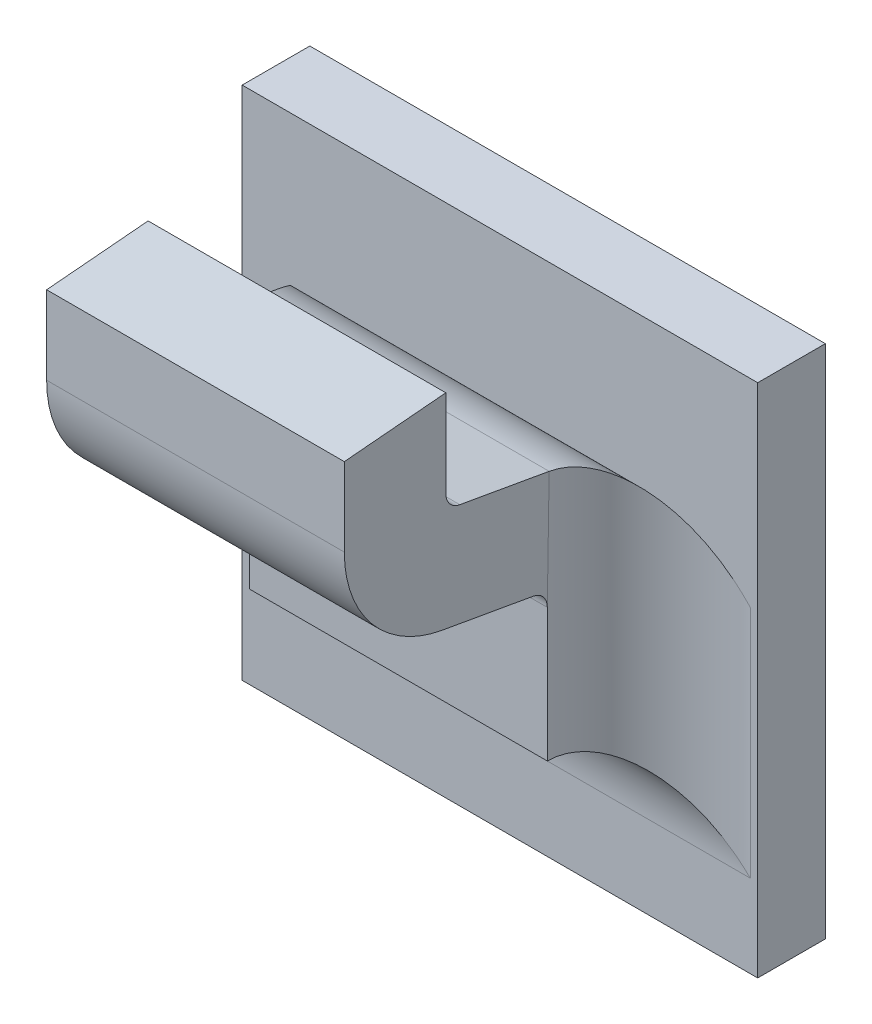
ISO-10303-21;
HEADER;
FILE_DESCRIPTION(('STEP AP214'),'2;1');
FILE_NAME('part.step','',(''),(''),'','','');
FILE_SCHEMA(('AUTOMOTIVE_DESIGN { 1 0 10303 214 1 1 1 1 }'));
ENDSEC;
DATA;
#1=APPLICATION_CONTEXT('core data for automotive mechanical design processes');
#2=APPLICATION_PROTOCOL_DEFINITION('international standard','automotive_design',2000,#1);
#3=PRODUCT_CONTEXT('',#1,'mechanical');
#4=PRODUCT('Part','Part','',(#3));
#5=PRODUCT_RELATED_PRODUCT_CATEGORY('part','',(#4));
#6=PRODUCT_DEFINITION_FORMATION('','',#4);
#7=PRODUCT_DEFINITION_CONTEXT('part definition',#1,'design');
#8=PRODUCT_DEFINITION('design','',#6,#7);
#9=PRODUCT_DEFINITION_SHAPE('','',#8);
#10=(LENGTH_UNIT() NAMED_UNIT(*) SI_UNIT(.MILLI.,.METRE.));
#11=(NAMED_UNIT(*) PLANE_ANGLE_UNIT() SI_UNIT($,.RADIAN.));
#12=(NAMED_UNIT(*) SI_UNIT($,.STERADIAN.) SOLID_ANGLE_UNIT());
#13=UNCERTAINTY_MEASURE_WITH_UNIT(LENGTH_MEASURE(1.E-05),#10,'distance_accuracy_value','');
#14=(GEOMETRIC_REPRESENTATION_CONTEXT(3) GLOBAL_UNCERTAINTY_ASSIGNED_CONTEXT((#13)) GLOBAL_UNIT_ASSIGNED_CONTEXT((#10,
#11,#12)) REPRESENTATION_CONTEXT('',''));
#15=CARTESIAN_POINT('',(0.,0.,0.));
#16=DIRECTION('',(0.,0.,1.));
#17=DIRECTION('',(1.,0.,0.));
#18=AXIS2_PLACEMENT_3D('',#15,#16,#17);
#19=CARTESIAN_POINT('',(0.184690982808015,-0.482280853090536,0.0797273267071123));
#20=DIRECTION('',(1.,0.,0.));
#21=DIRECTION('',(0.,1.,0.));
#22=AXIS2_PLACEMENT_3D('',#19,#20,#21);
#23=CYLINDRICAL_SURFACE('',#22,0.00098425196850394);
#24=DIRECTION('',(1.,0.,0.));
#25=VECTOR('',#24,1.);
#26=CARTESIAN_POINT('',(0.165635864697779,-0.482280853090536,0.0807115786756163));
#27=LINE('',#26,#25);
#28=CARTESIAN_POINT('',(0.183824841075731,-0.482280853090536,0.0807115786756163));
#29=VERTEX_POINT('',#28);
#30=CARTESIAN_POINT('',(0.166502006430062,-0.482280853090536,0.0807115786756163));
#31=VERTEX_POINT('',#30);
#32=EDGE_CURVE('E182',#29,#31,#27,.F.);
#33=ORIENTED_EDGE('',*,*,#32,.F.);
#34=CARTESIAN_POINT('',(0.183824841075731,-0.482280853090536,0.0797273267071123));
#35=DIRECTION('',(1.,0.,0.));
#36=DIRECTION('',(0.,1.,0.));
#37=AXIS2_PLACEMENT_3D('',#34,#35,#36);
#38=CIRCLE('',#37,0.00098425196850394);
#39=CARTESIAN_POINT('',(0.183824841075731,-0.483250152060037,0.0798982402678082));
#40=VERTEX_POINT('',#39);
#41=EDGE_CURVE('E155',#40,#29,#38,.F.);
#42=ORIENTED_EDGE('',*,*,#41,.F.);
#43=DIRECTION('',(1.,0.,0.));
#44=VECTOR('',#43,1.);
#45=CARTESIAN_POINT('',(0.165631671913121,-0.483250152060037,0.0798982402678081));
#46=LINE('',#45,#44);
#47=CARTESIAN_POINT('',(0.166502006430062,-0.483250152060037,0.0798982402678082));
#48=VERTEX_POINT('',#47);
#49=EDGE_CURVE('E137',#48,#40,#46,.T.);
#50=ORIENTED_EDGE('',*,*,#49,.F.);
#51=CARTESIAN_POINT('',(0.166502006430062,-0.482280853090536,0.0797273267071123));
#52=DIRECTION('',(1.,0.,0.));
#53=DIRECTION('',(0.,1.,0.));
#54=AXIS2_PLACEMENT_3D('',#51,#52,#53);
#55=CIRCLE('',#54,0.00098425196850394);
#56=EDGE_CURVE('E148',#48,#31,#55,.F.);
#57=ORIENTED_EDGE('',*,*,#56,.T.);
#58=EDGE_LOOP('',(#33,#42,#50,#57));
#59=FACE_BOUND('',#58,.T.);
#60=ADVANCED_FACE('F17',(#59),#23,.F.);
#61=CARTESIAN_POINT('',(0.165635864697779,-0.482534695884412,0.0807115786756163));
#62=DIRECTION('',(0.,0.,-1.));
#63=DIRECTION('',(0.,1.,0.));
#64=AXIS2_PLACEMENT_3D('',#61,#62,#63);
#65=PLANE('',#64);
#66=ORIENTED_EDGE('',*,*,#32,.T.);
#67=DIRECTION('',(0.,1.,0.));
#68=VECTOR('',#67,1.);
#69=CARTESIAN_POINT('',(0.166502006430062,-0.491658866021042,0.0807115786756163));
#70=LINE('',#69,#68);
#71=CARTESIAN_POINT('',(0.166502006430062,-0.477203997213029,0.0807115786756163));
#72=VERTEX_POINT('',#71);
#73=EDGE_CURVE('E177',#31,#72,#70,.T.);
#74=ORIENTED_EDGE('',*,*,#73,.T.);
#75=DIRECTION('',(1.,0.,0.));
#76=VECTOR('',#75,1.);
#77=CARTESIAN_POINT('',(0.137663423752897,-0.477203997213029,0.0807115786756163));
#78=LINE('',#77,#76);
#79=CARTESIAN_POINT('',(0.183824841075731,-0.477203997213029,0.0807115786756163));
#80=VERTEX_POINT('',#79);
#81=EDGE_CURVE('E170',#72,#80,#78,.T.);
#82=ORIENTED_EDGE('',*,*,#81,.T.);
#83=DIRECTION('',(0.,1.,0.));
#84=VECTOR('',#83,1.);
#85=CARTESIAN_POINT('',(0.183824841075731,-0.491658866021042,0.0807115786756163));
#86=LINE('',#85,#84);
#87=EDGE_CURVE('E189',#29,#80,#86,.T.);
#88=ORIENTED_EDGE('',*,*,#87,.F.);
#89=EDGE_LOOP('',(#66,#74,#82,#88));
#90=FACE_BOUND('',#89,.T.);
#91=ADVANCED_FACE('F376',(#90),#65,.T.);
#92=CARTESIAN_POINT('',(0.137663423752897,-0.477562594630968,0.0848103659183002));
#93=DIRECTION('',(0.,-0.996194698091746,-0.0871557427476516));
#94=DIRECTION('',(0.,0.0871557427476516,-0.996194698091746));
#95=AXIS2_PLACEMENT_3D('',#92,#93,#94);
#96=PLANE('',#95);
#97=DIRECTION('',(0.,-0.0871557427476615,0.996194698091745));
#98=VECTOR('',#97,1.);
#99=CARTESIAN_POINT('',(0.183824841075731,-0.477203997213029,0.0807115786756163));
#100=LINE('',#99,#98);
#101=CARTESIAN_POINT('',(0.183824841075731,-0.477720662548812,0.0866170904866399));
#102=VERTEX_POINT('',#101);
#103=EDGE_CURVE('E186',#80,#102,#100,.T.);
#104=ORIENTED_EDGE('',*,*,#103,.F.);
#105=ORIENTED_EDGE('',*,*,#81,.F.);
#106=DIRECTION('',(0.,-0.0871557427476615,0.996194698091745));
#107=VECTOR('',#106,1.);
#108=CARTESIAN_POINT('',(0.166502006430062,-0.477203997213029,0.0807115786756163));
#109=LINE('',#108,#107);
#110=CARTESIAN_POINT('',(0.166502006430062,-0.477720662548812,0.08661709048664));
#111=VERTEX_POINT('',#110);
#112=EDGE_CURVE('E173',#72,#111,#109,.T.);
#113=ORIENTED_EDGE('',*,*,#112,.T.);
#114=DIRECTION('',(1.,0.,0.));
#115=VECTOR('',#114,1.);
#116=CARTESIAN_POINT('',(0.165635864697779,-0.477720662548812,0.0866170904866399));
#117=LINE('',#116,#115);
#118=EDGE_CURVE('E167',#111,#102,#117,.T.);
#119=ORIENTED_EDGE('',*,*,#118,.T.);
#120=EDGE_LOOP('',(#104,#105,#113,#119));
#121=FACE_BOUND('',#120,.T.);
#122=ADVANCED_FACE('F380',(#121),#96,.F.);
#123=CARTESIAN_POINT('',(0.165635864697779,-0.482508862617623,0.0866170904866399));
#124=DIRECTION('',(0.,0.,-1.));
#125=DIRECTION('',(0.,1.,0.));
#126=AXIS2_PLACEMENT_3D('',#123,#124,#125);
#127=PLANE('',#126);
#128=ORIENTED_EDGE('',*,*,#118,.F.);
#129=DIRECTION('',(0.,1.,0.));
#130=VECTOR('',#129,1.);
#131=CARTESIAN_POINT('',(0.166502006430062,-0.491658866021042,0.08661709048664));
#132=LINE('',#131,#130);
#133=CARTESIAN_POINT('',(0.166502006430062,-0.482280853090536,0.0866170904866399));
#134=VERTEX_POINT('',#133);
#135=EDGE_CURVE('E176',#111,#134,#132,.F.);
#136=ORIENTED_EDGE('',*,*,#135,.T.);
#137=DIRECTION('',(1.,0.,0.));
#138=VECTOR('',#137,1.);
#139=CARTESIAN_POINT('',(0.184690982808015,-0.482280853090536,0.0866170904866399));
#140=LINE('',#139,#138);
#141=CARTESIAN_POINT('',(0.183824841075731,-0.482280853090536,0.0866170904866399));
#142=VERTEX_POINT('',#141);
#143=EDGE_CURVE('E165',#142,#134,#140,.F.);
#144=ORIENTED_EDGE('',*,*,#143,.F.);
#145=DIRECTION('',(0.,1.,0.));
#146=VECTOR('',#145,1.);
#147=CARTESIAN_POINT('',(0.183824841075731,-0.491658866021042,0.08661709048664));
#148=LINE('',#147,#146);
#149=EDGE_CURVE('E188',#102,#142,#148,.F.);
#150=ORIENTED_EDGE('',*,*,#149,.F.);
#151=EDGE_LOOP('',(#128,#136,#144,#150));
#152=FACE_BOUND('',#151,.T.);
#153=ADVANCED_FACE('F384',(#152),#127,.F.);
#154=CARTESIAN_POINT('',(0.184690982808015,-0.482280853090536,0.0797273267071123));
#155=DIRECTION('',(1.,0.,0.));
#156=DIRECTION('',(0.,1.,0.));
#157=AXIS2_PLACEMENT_3D('',#154,#155,#156);
#158=CYLINDRICAL_SURFACE('',#157,0.00688976377952756);
#159=CARTESIAN_POINT('',(0.183824841075731,-0.482280853090536,0.0797273267071123));
#160=DIRECTION('',(1.,0.,0.));
#161=DIRECTION('',(0.,1.,0.));
#162=AXIS2_PLACEMENT_3D('',#159,#160,#161);
#163=CIRCLE('',#162,0.00688976377952756);
#164=CARTESIAN_POINT('',(0.183824841075731,-0.489065945877038,0.0809237216319825));
#165=VERTEX_POINT('',#164);
#166=EDGE_CURVE('E146',#142,#165,#163,.T.);
#167=ORIENTED_EDGE('',*,*,#166,.F.);
#168=ORIENTED_EDGE('',*,*,#143,.T.);
#169=CARTESIAN_POINT('',(0.166502006430062,-0.482280853090536,0.0797273267071123));
#170=DIRECTION('',(1.,0.,0.));
#171=DIRECTION('',(0.,1.,0.));
#172=AXIS2_PLACEMENT_3D('',#169,#170,#171);
#173=CIRCLE('',#172,0.00688976377952756);
#174=CARTESIAN_POINT('',(0.166502006430062,-0.489065945877038,0.0809237216319825));
#175=VERTEX_POINT('',#174);
#176=EDGE_CURVE('E235',#134,#175,#173,.T.);
#177=ORIENTED_EDGE('',*,*,#176,.T.);
#178=DIRECTION('',(1.,0.,0.));
#179=VECTOR('',#178,1.);
#180=CARTESIAN_POINT('',(0.165635864697779,-0.489065945877038,0.0809237216319829));
#181=LINE('',#180,#179);
#182=EDGE_CURVE('E138',#175,#165,#181,.T.);
#183=ORIENTED_EDGE('',*,*,#182,.T.);
#184=EDGE_LOOP('',(#167,#168,#177,#183));
#185=FACE_BOUND('',#184,.T.);
#186=ADVANCED_FACE('F388',(#185),#158,.T.);
#187=CARTESIAN_POINT('',(0.165635864697779,-0.490048004669866,0.0753541894544217));
#188=DIRECTION('',(0.,0.984807753012208,-0.17364817766693));
#189=DIRECTION('',(0.,0.17364817766693,0.984807753012208));
#190=AXIS2_PLACEMENT_3D('',#187,#188,#189);
#191=PLANE('',#190);
#192=DIRECTION('',(1.,0.,0.));
#193=VECTOR('',#192,1.);
#194=CARTESIAN_POINT('',(0.184690982808015,-0.490001239965446,0.0756194052724009));
#195=LINE('',#194,#193);
#196=CARTESIAN_POINT('',(0.166502006430062,-0.490001239965445,0.0756194052724009));
#197=VERTEX_POINT('',#196);
#198=CARTESIAN_POINT('',(0.183824841075731,-0.490001239965445,0.0756194052724009));
#199=VERTEX_POINT('',#198);
#200=EDGE_CURVE('E127',#197,#199,#195,.T.);
#201=ORIENTED_EDGE('',*,*,#200,.T.);
#202=DIRECTION('',(0.,-0.173648177666803,-0.98480775301223));
#203=VECTOR('',#202,1.);
#204=CARTESIAN_POINT('',(0.183824841075731,-0.489065945877038,0.0809237216319829));
#205=LINE('',#204,#203);
#206=EDGE_CURVE('E130',#165,#199,#205,.T.);
#207=ORIENTED_EDGE('',*,*,#206,.F.);
#208=ORIENTED_EDGE('',*,*,#182,.F.);
#209=DIRECTION('',(0.,-0.173648177666803,-0.98480775301223));
#210=VECTOR('',#209,1.);
#211=CARTESIAN_POINT('',(0.166502006430062,-0.489065945877038,0.0809237216319829));
#212=LINE('',#211,#210);
#213=EDGE_CURVE('E132',#175,#197,#212,.T.);
#214=ORIENTED_EDGE('',*,*,#213,.T.);
#215=EDGE_LOOP('',(#201,#207,#208,#214));
#216=FACE_BOUND('',#215,.T.);
#217=ADVANCED_FACE('F129',(#216),#191,.F.);
#218=CARTESIAN_POINT('',(0.184690982808015,-0.490970538934946,0.0757903188330966));
#219=DIRECTION('',(1.,0.,0.));
#220=DIRECTION('',(0.,1.,0.));
#221=AXIS2_PLACEMENT_3D('',#218,#219,#220);
#222=CYLINDRICAL_SURFACE('',#221,0.00098425196850394);
#223=DIRECTION('',(1.,0.,0.));
#224=VECTOR('',#223,1.);
#225=CARTESIAN_POINT('',(0.165635864697779,-0.490970538934946,0.0748060668645926));
#226=LINE('',#225,#224);
#227=CARTESIAN_POINT('',(0.166502006430062,-0.490970538934946,0.0748060668645927));
#228=VERTEX_POINT('',#227);
#229=CARTESIAN_POINT('',(0.183824841075731,-0.490970538934946,0.0748060668645926));
#230=VERTEX_POINT('',#229);
#231=EDGE_CURVE('E151',#228,#230,#226,.T.);
#232=ORIENTED_EDGE('',*,*,#231,.T.);
#233=CARTESIAN_POINT('',(0.183824841075731,-0.490970538934946,0.0757903188330966));
#234=DIRECTION('',(1.,0.,0.));
#235=DIRECTION('',(0.,1.,0.));
#236=AXIS2_PLACEMENT_3D('',#233,#234,#235);
#237=CIRCLE('',#236,0.00098425196850394);
#238=EDGE_CURVE('E20',#199,#230,#237,.F.);
#239=ORIENTED_EDGE('',*,*,#238,.F.);
#240=ORIENTED_EDGE('',*,*,#200,.F.);
#241=CARTESIAN_POINT('',(0.166502006430062,-0.490970538934946,0.0757903188330966));
#242=DIRECTION('',(1.,0.,0.));
#243=DIRECTION('',(0.,1.,0.));
#244=AXIS2_PLACEMENT_3D('',#241,#242,#243);
#245=CIRCLE('',#244,0.00098425196850394);
#246=EDGE_CURVE('E232',#197,#228,#245,.F.);
#247=ORIENTED_EDGE('',*,*,#246,.T.);
#248=EDGE_LOOP('',(#232,#239,#240,#247));
#249=FACE_BOUND('',#248,.T.);
#250=ADVANCED_FACE('F150',(#249),#222,.F.);
#251=CARTESIAN_POINT('',(0.165631671913121,-0.484232210852865,0.0743287080902469));
#252=DIRECTION('',(0.,0.984807753012208,-0.17364817766693));
#253=DIRECTION('',(0.,0.17364817766693,0.984807753012208));
#254=AXIS2_PLACEMENT_3D('',#251,#252,#253);
#255=PLANE('',#254);
#256=DIRECTION('',(0.,0.173648177666938,0.984807753012207));
#257=VECTOR('',#256,1.);
#258=CARTESIAN_POINT('',(0.183824841075731,-0.48414803962147,0.0748060668645927));
#259=LINE('',#258,#257);
#260=CARTESIAN_POINT('',(0.18382674688694,-0.484166742884957,0.0746999953864094));
#261=VERTEX_POINT('',#260);
#262=EDGE_CURVE('E153',#261,#40,#259,.T.);
#263=ORIENTED_EDGE('',*,*,#262,.F.);
#264=DIRECTION('',(1.,0.,0.));
#265=VECTOR('',#264,1.);
#266=CARTESIAN_POINT('',(0.191187045800141,-0.484185446148445,0.0745939239082261));
#267=LINE('',#266,#265);
#268=CARTESIAN_POINT('',(0.166500100618853,-0.484166742884957,0.0746999953864094));
#269=VERTEX_POINT('',#268);
#270=EDGE_CURVE('E264',#269,#261,#267,.T.);
#271=ORIENTED_EDGE('',*,*,#270,.F.);
#272=DIRECTION('',(0.,0.173648177666938,0.984807753012207));
#273=VECTOR('',#272,1.);
#274=CARTESIAN_POINT('',(0.166502006430062,-0.48414803962147,0.0748060668645927));
#275=LINE('',#274,#273);
#276=EDGE_CURVE('E234',#269,#48,#275,.T.);
#277=ORIENTED_EDGE('',*,*,#276,.T.);
#278=ORIENTED_EDGE('',*,*,#49,.T.);
#279=EDGE_LOOP('',(#263,#271,#277,#278));
#280=FACE_BOUND('',#279,.T.);
#281=ADVANCED_FACE('F373',(#280),#255,.T.);
#282=CARTESIAN_POINT('',(0.183824841075731,-0.491658866021042,0.0742155156834903));
#283=DIRECTION('',(1.,0.,0.));
#284=DIRECTION('',(0.,1.,0.));
#285=AXIS2_PLACEMENT_3D('',#282,#283,#284);
#286=PLANE('',#285);
#287=ORIENTED_EDGE('',*,*,#166,.T.);
#288=ORIENTED_EDGE('',*,*,#206,.T.);
#289=ORIENTED_EDGE('',*,*,#238,.T.);
#290=DIRECTION('',(0.,-1.,0.));
#291=VECTOR('',#290,1.);
#292=CARTESIAN_POINT('',(0.183824841075731,-0.505642557779639,0.0748060668645926));
#293=LINE('',#292,#291);
#294=EDGE_CURVE('E271',#230,#261,#293,.F.);
#295=ORIENTED_EDGE('',*,*,#294,.T.);
#296=ORIENTED_EDGE('',*,*,#262,.T.);
#297=ORIENTED_EDGE('',*,*,#41,.T.);
#298=ORIENTED_EDGE('',*,*,#87,.T.);
#299=ORIENTED_EDGE('',*,*,#103,.T.);
#300=ORIENTED_EDGE('',*,*,#149,.T.);
#301=EDGE_LOOP('',(#287,#288,#289,#295,#296,#297,#298,#299,#300));
#302=FACE_BOUND('',#301,.T.);
#303=ADVANCED_FACE('F142',(#302),#286,.T.);
#304=CARTESIAN_POINT('',(0.166502006430062,-0.491658866021042,0.0742155156834903));
#305=DIRECTION('',(1.,0.,0.));
#306=DIRECTION('',(0.,1.,0.));
#307=AXIS2_PLACEMENT_3D('',#304,#305,#306);
#308=PLANE('',#307);
#309=DIRECTION('',(0.,1.,0.));
#310=VECTOR('',#309,1.);
#311=CARTESIAN_POINT('',(0.166502006430062,-0.483124491137747,0.0748060668645927));
#312=LINE('',#311,#310);
#313=EDGE_CURVE('E290',#269,#228,#312,.F.);
#314=ORIENTED_EDGE('',*,*,#313,.T.);
#315=ORIENTED_EDGE('',*,*,#246,.F.);
#316=ORIENTED_EDGE('',*,*,#213,.F.);
#317=ORIENTED_EDGE('',*,*,#176,.F.);
#318=ORIENTED_EDGE('',*,*,#135,.F.);
#319=ORIENTED_EDGE('',*,*,#112,.F.);
#320=ORIENTED_EDGE('',*,*,#73,.F.);
#321=ORIENTED_EDGE('',*,*,#56,.F.);
#322=ORIENTED_EDGE('',*,*,#276,.F.);
#323=EDGE_LOOP('',(#314,#315,#316,#317,#318,#319,#320,#321,#322));
#324=FACE_BOUND('',#323,.T.);
#325=ADVANCED_FACE('F371',(#324),#308,.F.);
#326=CARTESIAN_POINT('',(0.165635864697779,-0.49910064541239,0.0748060668645926));
#327=DIRECTION('',(0.,0.,-1.));
#328=DIRECTION('',(0.,1.,0.));
#329=AXIS2_PLACEMENT_3D('',#326,#327,#328);
#330=PLANE('',#329);
#331=DIRECTION('',(-1.,0.,0.));
#332=VECTOR('',#331,1.);
#333=CARTESIAN_POINT('',(0.137663423752897,-0.498713497484892,0.0748060668645926));
#334=LINE('',#333,#332);
#335=CARTESIAN_POINT('',(0.166502006430062,-0.498713497484892,0.0748060668645926));
#336=VERTEX_POINT('',#335);
#337=CARTESIAN_POINT('',(0.183824841075731,-0.498713497484892,0.0748060668645926));
#338=VERTEX_POINT('',#337);
#339=EDGE_CURVE('E275',#336,#338,#334,.F.);
#340=ORIENTED_EDGE('',*,*,#339,.T.);
#341=DIRECTION('',(0.,-1.,0.));
#342=VECTOR('',#341,1.);
#343=CARTESIAN_POINT('',(0.183824841075731,-0.505642557779639,0.0748060668645926));
#344=LINE('',#343,#342);
#345=EDGE_CURVE('E268',#338,#230,#344,.F.);
#346=ORIENTED_EDGE('',*,*,#345,.T.);
#347=ORIENTED_EDGE('',*,*,#231,.F.);
#348=DIRECTION('',(0.,1.,0.));
#349=VECTOR('',#348,1.);
#350=CARTESIAN_POINT('',(0.166502006430062,-0.483124491137747,0.0748060668645926));
#351=LINE('',#350,#349);
#352=EDGE_CURVE('E293',#228,#336,#351,.F.);
#353=ORIENTED_EDGE('',*,*,#352,.T.);
#354=EDGE_LOOP('',(#340,#346,#347,#353));
#355=FACE_BOUND('',#354,.T.);
#356=ADVANCED_FACE('F369',(#355),#330,.F.);
#357=CARTESIAN_POINT('',(0.191187045800141,-0.490970538934946,0.0757903188330966));
#358=DIRECTION('',(1.,0.,0.));
#359=DIRECTION('',(0.,1.,0.));
#360=AXIS2_PLACEMENT_3D('',#357,#358,#359);
#361=CYLINDRICAL_SURFACE('',#360,0.00688976377952756);
#362=ORIENTED_EDGE('',*,*,#270,.T.);
#363=CARTESIAN_POINT('',(0.18382584705188,-0.484167631527071,0.0747001216257358));
#364=CARTESIAN_POINT('',(0.183830746400047,-0.484214408974995,0.0744052234333631));
#365=CARTESIAN_POINT('',(0.183858349030783,-0.484280966886792,0.074115034151789));
#366=CARTESIAN_POINT('',(0.183952289382906,-0.484447482121032,0.073553844729337));
#367=CARTESIAN_POINT('',(0.184018258902216,-0.484547118148503,0.0732826892737776));
#368=CARTESIAN_POINT('',(0.184182242620427,-0.484774233375055,0.0727646055784552));
#369=CARTESIAN_POINT('',(0.184280119745007,-0.484901592711233,0.0725175794773051));
#370=CARTESIAN_POINT('',(0.184501721201638,-0.485178958131144,0.0720485533086558));
#371=CARTESIAN_POINT('',(0.184625512286216,-0.485329022418919,0.0718266201983146));
#372=CARTESIAN_POINT('',(0.184961780246565,-0.485728040852456,0.0713022915327616));
#373=CARTESIAN_POINT('',(0.185187229821375,-0.485988312130857,0.0710168133445038));
#374=CARTESIAN_POINT('',(0.185669306450927,-0.486535947935682,0.070504056702723));
#375=CARTESIAN_POINT('',(0.185926004972526,-0.486823374216995,0.0702769154978246));
#376=CARTESIAN_POINT('',(0.186560055176599,-0.487527037812419,0.0698026326616958));
#377=CARTESIAN_POINT('',(0.186946643806099,-0.487951268913421,0.0695797433223629));
#378=CARTESIAN_POINT('',(0.187740499974624,-0.488817388979215,0.0692289934880923));
#379=CARTESIAN_POINT('',(0.188147751769603,-0.489259264447,0.0691010617693635));
#380=CARTESIAN_POINT('',(0.188829419657663,-0.489997147024509,0.0689631980798835));
#381=CARTESIAN_POINT('',(0.189101299537579,-0.490291001061431,0.0689278051732856));
#382=CARTESIAN_POINT('',(0.189492532956124,-0.490713663984163,0.0689041494171859));
#383=CARTESIAN_POINT('',(0.189611448383415,-0.490842107141949,0.068900564537093));
#384=CARTESIAN_POINT('',(0.189730352886755,-0.490970538934946,0.068900555053569));
#385=B_SPLINE_CURVE_WITH_KNOTS('',3,(#363,#364,#365,#366,#367,#368,#369,#370,#371,#372,#373,
#374,#375,#376,#377,#378,#379,#380,#381,#382,#383,#384),.UNSPECIFIED.,.F.,.F.,(4,2,2,2,2,2,2,2,
2,2,4),(0.,0.000892674275674727,0.00177691981761761,0.00265741564566999,0.00354020811045546,
0.00487460341316192,0.00621210995073975,0.00804949445936676,0.00988549942521251,0.011089431284,
0.0116145091100796),.UNSPECIFIED.);
#386=CARTESIAN_POINT('',(0.189730352886755,-0.490970538934946,0.068900555053569));
#387=VERTEX_POINT('',#386);
#388=EDGE_CURVE('E231',#261,#387,#385,.T.);
#389=ORIENTED_EDGE('',*,*,#388,.T.);
#390=DIRECTION('',(1.,0.,0.));
#391=VECTOR('',#390,1.);
#392=CARTESIAN_POINT('',(0.137663423752897,-0.490970538934946,0.068900555053569));
#393=LINE('',#392,#391);
#394=CARTESIAN_POINT('',(0.160596494619038,-0.490970538934946,0.068900555053569));
#395=VERTEX_POINT('',#394);
#396=EDGE_CURVE('E195',#395,#387,#393,.T.);
#397=ORIENTED_EDGE('',*,*,#396,.F.);
#398=CARTESIAN_POINT('',(0.166501000453913,-0.484167631527071,0.0747001216257358));
#399=CARTESIAN_POINT('',(0.166496101105746,-0.484214408974995,0.0744052234333631));
#400=CARTESIAN_POINT('',(0.16646849847501,-0.484280966886792,0.0741150341517891));
#401=CARTESIAN_POINT('',(0.166374558122887,-0.484447482121032,0.073553844729337));
#402=CARTESIAN_POINT('',(0.166308588603577,-0.484547118148504,0.0732826892737777));
#403=CARTESIAN_POINT('',(0.166144604885366,-0.484774233375055,0.0727646055784552));
#404=CARTESIAN_POINT('',(0.166046727760786,-0.484901592711233,0.0725175794773052));
#405=CARTESIAN_POINT('',(0.165825126304155,-0.485178958131144,0.0720485533086558));
#406=CARTESIAN_POINT('',(0.165701335219577,-0.485329022418919,0.0718266201983146));
#407=CARTESIAN_POINT('',(0.165365067259228,-0.485728040852456,0.0713022915327616));
#408=CARTESIAN_POINT('',(0.165139617684418,-0.485988312130857,0.0710168133445038));
#409=CARTESIAN_POINT('',(0.164657541054866,-0.486535947935682,0.070504056702723));
#410=CARTESIAN_POINT('',(0.164400842533267,-0.486823374216995,0.0702769154978246));
#411=CARTESIAN_POINT('',(0.163766792329194,-0.487527037812419,0.0698026326616958));
#412=CARTESIAN_POINT('',(0.163380203699693,-0.487951268913421,0.0695797433223629));
#413=CARTESIAN_POINT('',(0.162586347531169,-0.488817388979215,0.0692289934880923));
#414=CARTESIAN_POINT('',(0.16217909573619,-0.489259264447,0.0691010617693636));
#415=CARTESIAN_POINT('',(0.16149742784813,-0.489997147024509,0.0689631980798835));
#416=CARTESIAN_POINT('',(0.161225547968213,-0.49029100106143,0.0689278051732857));
#417=CARTESIAN_POINT('',(0.160834314549669,-0.490713663984162,0.0689041494171859));
#418=CARTESIAN_POINT('',(0.160715399122378,-0.490842107141948,0.0689005645370931));
#419=CARTESIAN_POINT('',(0.160596494619038,-0.490970538934946,0.0689005550535691));
#420=B_SPLINE_CURVE_WITH_KNOTS('',3,(#398,#399,#400,#401,#402,#403,#404,#405,#406,#407,#408,
#409,#410,#411,#412,#413,#414,#415,#416,#417,#418,#419),.UNSPECIFIED.,.F.,.F.,(4,2,2,2,2,2,2,2,
2,2,4),(0.,0.000892674275674716,0.00177691981761761,0.00265741564566996,0.00354020811045542,
0.00487460341316197,0.00621210995073975,0.00804949445936685,0.00988549942521248,
0.0110894312839999,0.0116145091100796),.UNSPECIFIED.);
#421=EDGE_CURVE('E192',#395,#269,#420,.F.);
#422=ORIENTED_EDGE('',*,*,#421,.T.);
#423=EDGE_LOOP('',(#362,#389,#397,#422));
#424=FACE_BOUND('',#423,.T.);
#425=ADVANCED_FACE('F205',(#424),#361,.T.);
#426=CARTESIAN_POINT('',(0.189730352886755,-0.505642557779639,0.0748060668645926));
#427=DIRECTION('',(0.,-1.,0.));
#428=DIRECTION('',(1.,0.,0.));
#429=AXIS2_PLACEMENT_3D('',#426,#427,#428);
#430=CYLINDRICAL_SURFACE('',#429,0.00590551181102362);
#431=ORIENTED_EDGE('',*,*,#345,.F.);
#432=CARTESIAN_POINT('',(0.189730352886755,-0.504619009295916,0.0748060668645926));
#433=DIRECTION('',(-0.707106781186548,-0.707106781186547,0.));
#434=DIRECTION('',(0.707106781186547,-0.707106781186548,0.));
#435=AXIS2_PLACEMENT_3D('',#432,#433,#434);
#436=ELLIPSE('',#435,0.0083516548959041,0.00590551181102362);
#437=CARTESIAN_POINT('',(0.189730352886755,-0.504619009295916,0.068900555053569));
#438=VERTEX_POINT('',#437);
#439=EDGE_CURVE('E281',#338,#438,#436,.T.);
#440=ORIENTED_EDGE('',*,*,#439,.T.);
#441=DIRECTION('',(0.,-1.,0.));
#442=VECTOR('',#441,1.);
#443=CARTESIAN_POINT('',(0.189730352886755,-0.450161607430702,0.068900555053569));
#444=LINE('',#443,#442);
#445=EDGE_CURVE('E276',#387,#438,#444,.T.);
#446=ORIENTED_EDGE('',*,*,#445,.F.);
#447=ORIENTED_EDGE('',*,*,#388,.F.);
#448=ORIENTED_EDGE('',*,*,#294,.F.);
#449=EDGE_LOOP('',(#431,#440,#446,#447,#448));
#450=FACE_BOUND('',#449,.T.);
#451=ADVANCED_FACE('F219',(#450),#430,.F.);
#452=CARTESIAN_POINT('',(0.137663423752897,-0.504619009295916,0.0748060668645926));
#453=DIRECTION('',(-1.,0.,0.));
#454=DIRECTION('',(0.,-1.,0.));
#455=AXIS2_PLACEMENT_3D('',#452,#453,#454);
#456=CYLINDRICAL_SURFACE('',#455,0.00590551181102362);
#457=DIRECTION('',(1.,0.,0.));
#458=VECTOR('',#457,1.);
#459=CARTESIAN_POINT('',(0.137663423752897,-0.504619009295916,0.068900555053569));
#460=LINE('',#459,#458);
#461=CARTESIAN_POINT('',(0.160596494619038,-0.504619009295916,0.068900555053569));
#462=VERTEX_POINT('',#461);
#463=EDGE_CURVE('E278',#438,#462,#460,.F.);
#464=ORIENTED_EDGE('',*,*,#463,.F.);
#465=ORIENTED_EDGE('',*,*,#439,.F.);
#466=ORIENTED_EDGE('',*,*,#339,.F.);
#467=CARTESIAN_POINT('',(0.160596494619038,-0.504619009295916,0.0748060668645927));
#468=DIRECTION('',(-0.707106781186547,0.707106781186548,0.));
#469=DIRECTION('',(-0.707106781186548,-0.707106781186547,0.));
#470=AXIS2_PLACEMENT_3D('',#467,#468,#469);
#471=ELLIPSE('',#470,0.0083516548959041,0.00590551181102362);
#472=EDGE_CURVE('E196',#336,#462,#471,.T.);
#473=ORIENTED_EDGE('',*,*,#472,.T.);
#474=EDGE_LOOP('',(#464,#465,#466,#473));
#475=FACE_BOUND('',#474,.T.);
#476=ADVANCED_FACE('F215',(#475),#456,.F.);
#477=CARTESIAN_POINT('',(0.160596494619038,-0.483124491137747,0.0748060668645927));
#478=DIRECTION('',(0.,1.,0.));
#479=DIRECTION('',(-1.,0.,0.));
#480=AXIS2_PLACEMENT_3D('',#477,#478,#479);
#481=CYLINDRICAL_SURFACE('',#480,0.00590551181102362);
#482=DIRECTION('',(0.,-1.,0.));
#483=VECTOR('',#482,1.);
#484=CARTESIAN_POINT('',(0.160596494619038,-0.450161607430702,0.068900555053569));
#485=LINE('',#484,#483);
#486=EDGE_CURVE('E283',#462,#395,#485,.F.);
#487=ORIENTED_EDGE('',*,*,#486,.F.);
#488=ORIENTED_EDGE('',*,*,#472,.F.);
#489=ORIENTED_EDGE('',*,*,#352,.F.);
#490=ORIENTED_EDGE('',*,*,#313,.F.);
#491=ORIENTED_EDGE('',*,*,#421,.F.);
#492=EDGE_LOOP('',(#487,#488,#489,#490,#491));
#493=FACE_BOUND('',#492,.T.);
#494=ADVANCED_FACE('F209',(#493),#481,.F.);
#495=CARTESIAN_POINT('',(0.137663423752897,-0.450161607430702,0.068900555053569));
#496=DIRECTION('',(0.,0.,1.));
#497=DIRECTION('',(0.,-1.,0.));
#498=AXIS2_PLACEMENT_3D('',#495,#496,#497);
#499=PLANE('',#498);
#500=ORIENTED_EDGE('',*,*,#463,.T.);
#501=ORIENTED_EDGE('',*,*,#486,.T.);
#502=ORIENTED_EDGE('',*,*,#396,.T.);
#503=ORIENTED_EDGE('',*,*,#445,.T.);
#504=EDGE_LOOP('',(#500,#501,#502,#503));
#505=FACE_BOUND('',#504,.T.);
#506=DIRECTION('',(0.,-1.,0.));
#507=VECTOR('',#506,1.);
#508=CARTESIAN_POINT('',(0.190163423752897,-0.477932960090704,0.068900555053569));
#509=LINE('',#508,#507);
#510=CARTESIAN_POINT('',(0.190163423752896,-0.509432960090704,0.068900555053569));
#511=VERTEX_POINT('',#510);
#512=CARTESIAN_POINT('',(0.190163423752897,-0.479432960090704,0.068900555053569));
#513=VERTEX_POINT('',#512);
#514=EDGE_CURVE('E300',#511,#513,#509,.F.);
#515=ORIENTED_EDGE('',*,*,#514,.T.);
#516=DIRECTION('',(1.,0.,0.));
#517=VECTOR('',#516,1.);
#518=CARTESIAN_POINT('',(0.158663423752897,-0.479432960090704,0.068900555053569));
#519=LINE('',#518,#517);
#520=CARTESIAN_POINT('',(0.160163423752897,-0.479432960090704,0.068900555053569));
#521=VERTEX_POINT('',#520);
#522=EDGE_CURVE('E305',#513,#521,#519,.F.);
#523=ORIENTED_EDGE('',*,*,#522,.T.);
#524=DIRECTION('',(0.,1.,0.));
#525=VECTOR('',#524,1.);
#526=CARTESIAN_POINT('',(0.160163423752897,-0.510932960090704,0.068900555053569));
#527=LINE('',#526,#525);
#528=CARTESIAN_POINT('',(0.160163423752897,-0.509432960090704,0.068900555053569));
#529=VERTEX_POINT('',#528);
#530=EDGE_CURVE('E308',#521,#529,#527,.F.);
#531=ORIENTED_EDGE('',*,*,#530,.T.);
#532=DIRECTION('',(-1.,0.,0.));
#533=VECTOR('',#532,1.);
#534=CARTESIAN_POINT('',(0.191663423752896,-0.509432960090704,0.068900555053569));
#535=LINE('',#534,#533);
#536=EDGE_CURVE('E286',#529,#511,#535,.F.);
#537=ORIENTED_EDGE('',*,*,#536,.T.);
#538=EDGE_LOOP('',(#515,#523,#531,#537));
#539=FACE_BOUND('',#538,.T.);
#540=ADVANCED_FACE('F214',(#505,#539),#499,.T.);
#541=CARTESIAN_POINT('',(0.191663423752896,-0.509432960090704,0.0647666967858525));
#542=DIRECTION('',(0.,1.,0.));
#543=DIRECTION('',(-1.,0.,0.));
#544=AXIS2_PLACEMENT_3D('',#541,#542,#543);
#545=PLANE('',#544);
#546=DIRECTION('',(0.,0.,1.));
#547=VECTOR('',#546,1.);
#548=CARTESIAN_POINT('',(0.190163423752897,-0.509432960090704,0.0647666967858525));
#549=LINE('',#548,#547);
#550=CARTESIAN_POINT('',(0.190163423752896,-0.509432960090704,0.0649635471795533));
#551=VERTEX_POINT('',#550);
#552=EDGE_CURVE('E297',#551,#511,#549,.T.);
#553=ORIENTED_EDGE('',*,*,#552,.T.);
#554=ORIENTED_EDGE('',*,*,#536,.F.);
#555=DIRECTION('',(0.,0.,1.));
#556=VECTOR('',#555,1.);
#557=CARTESIAN_POINT('',(0.160163423752897,-0.509432960090704,0.0647666967858525));
#558=LINE('',#557,#556);
#559=CARTESIAN_POINT('',(0.160163423752897,-0.509432960090704,0.0649635471795533));
#560=VERTEX_POINT('',#559);
#561=EDGE_CURVE('E311',#529,#560,#558,.F.);
#562=ORIENTED_EDGE('',*,*,#561,.T.);
#563=DIRECTION('',(1.,0.,0.));
#564=VECTOR('',#563,1.);
#565=CARTESIAN_POINT('',(0.137663423752897,-0.509432960090704,0.0649635471795533));
#566=LINE('',#565,#564);
#567=EDGE_CURVE('E314',#560,#551,#566,.T.);
#568=ORIENTED_EDGE('',*,*,#567,.T.);
#569=EDGE_LOOP('',(#553,#554,#562,#568));
#570=FACE_BOUND('',#569,.T.);
#571=ADVANCED_FACE('F332',(#570),#545,.F.);
#572=CARTESIAN_POINT('',(0.190163423752897,-0.477932960090704,0.0647666967858525));
#573=DIRECTION('',(-1.,0.,0.));
#574=DIRECTION('',(0.,-1.,0.));
#575=AXIS2_PLACEMENT_3D('',#572,#573,#574);
#576=PLANE('',#575);
#577=DIRECTION('',(0.,0.,1.));
#578=VECTOR('',#577,1.);
#579=CARTESIAN_POINT('',(0.190163423752897,-0.479432960090704,0.0647666967858525));
#580=LINE('',#579,#578);
#581=CARTESIAN_POINT('',(0.190163423752897,-0.479432960090704,0.0649635471795533));
#582=VERTEX_POINT('',#581);
#583=EDGE_CURVE('E302',#582,#513,#580,.T.);
#584=ORIENTED_EDGE('',*,*,#583,.T.);
#585=ORIENTED_EDGE('',*,*,#514,.F.);
#586=ORIENTED_EDGE('',*,*,#552,.F.);
#587=DIRECTION('',(0.,-1.,0.));
#588=VECTOR('',#587,1.);
#589=CARTESIAN_POINT('',(0.190163423752896,-0.450161607430702,0.0649635471795533));
#590=LINE('',#589,#588);
#591=EDGE_CURVE('E317',#551,#582,#590,.F.);
#592=ORIENTED_EDGE('',*,*,#591,.T.);
#593=EDGE_LOOP('',(#584,#585,#586,#592));
#594=FACE_BOUND('',#593,.T.);
#595=ADVANCED_FACE('F329',(#594),#576,.F.);
#596=CARTESIAN_POINT('',(0.158663423752897,-0.479432960090704,0.0647666967858525));
#597=DIRECTION('',(0.,-1.,0.));
#598=DIRECTION('',(1.,0.,0.));
#599=AXIS2_PLACEMENT_3D('',#596,#597,#598);
#600=PLANE('',#599);
#601=DIRECTION('',(0.,0.,1.));
#602=VECTOR('',#601,1.);
#603=CARTESIAN_POINT('',(0.160163423752897,-0.479432960090704,0.0647666967858525));
#604=LINE('',#603,#602);
#605=CARTESIAN_POINT('',(0.160163423752897,-0.479432960090704,0.0649635471795533));
#606=VERTEX_POINT('',#605);
#607=EDGE_CURVE('E34',#606,#521,#604,.T.);
#608=ORIENTED_EDGE('',*,*,#607,.T.);
#609=ORIENTED_EDGE('',*,*,#522,.F.);
#610=ORIENTED_EDGE('',*,*,#583,.F.);
#611=DIRECTION('',(1.,0.,0.));
#612=VECTOR('',#611,1.);
#613=CARTESIAN_POINT('',(0.137663423752897,-0.479432960090704,0.0649635471795533));
#614=LINE('',#613,#612);
#615=EDGE_CURVE('E26',#582,#606,#614,.F.);
#616=ORIENTED_EDGE('',*,*,#615,.T.);
#617=EDGE_LOOP('',(#608,#609,#610,#616));
#618=FACE_BOUND('',#617,.T.);
#619=ADVANCED_FACE('F323',(#618),#600,.F.);
#620=CARTESIAN_POINT('',(0.160163423752897,-0.510932960090704,0.0647666967858525));
#621=DIRECTION('',(1.,0.,0.));
#622=DIRECTION('',(0.,1.,0.));
#623=AXIS2_PLACEMENT_3D('',#620,#621,#622);
#624=PLANE('',#623);
#625=ORIENTED_EDGE('',*,*,#561,.F.);
#626=ORIENTED_EDGE('',*,*,#530,.F.);
#627=ORIENTED_EDGE('',*,*,#607,.F.);
#628=DIRECTION('',(0.,-1.,0.));
#629=VECTOR('',#628,1.);
#630=CARTESIAN_POINT('',(0.160163423752897,-0.450161607430702,0.0649635471795533));
#631=LINE('',#630,#629);
#632=EDGE_CURVE('E11',#606,#560,#631,.T.);
#633=ORIENTED_EDGE('',*,*,#632,.T.);
#634=EDGE_LOOP('',(#625,#626,#627,#633));
#635=FACE_BOUND('',#634,.T.);
#636=ADVANCED_FACE('F334',(#635),#624,.F.);
#637=CARTESIAN_POINT('',(0.137663423752897,-0.450161607430702,0.0649635471795533));
#638=DIRECTION('',(0.,0.,1.));
#639=DIRECTION('',(0.,-1.,0.));
#640=AXIS2_PLACEMENT_3D('',#637,#638,#639);
#641=PLANE('',#640);
#642=ORIENTED_EDGE('',*,*,#615,.F.);
#643=ORIENTED_EDGE('',*,*,#591,.F.);
#644=ORIENTED_EDGE('',*,*,#567,.F.);
#645=ORIENTED_EDGE('',*,*,#632,.F.);
#646=EDGE_LOOP('',(#642,#643,#644,#645));
#647=FACE_BOUND('',#646,.T.);
#648=ADVANCED_FACE('F327',(#647),#641,.F.);
#649=CLOSED_SHELL('',(#60,#91,#122,#153,#186,#217,#250,#281,#303,#325,#356,#425,#451,#476,#494,
#540,#571,#595,#619,#636,#648));
#650=MANIFOLD_SOLID_BREP('B1',#649);
#651=ADVANCED_BREP_SHAPE_REPRESENTATION('',(#18,#650),#14);
#652=SHAPE_DEFINITION_REPRESENTATION(#9,#651);
ENDSEC;
END-ISO-10303-21;
